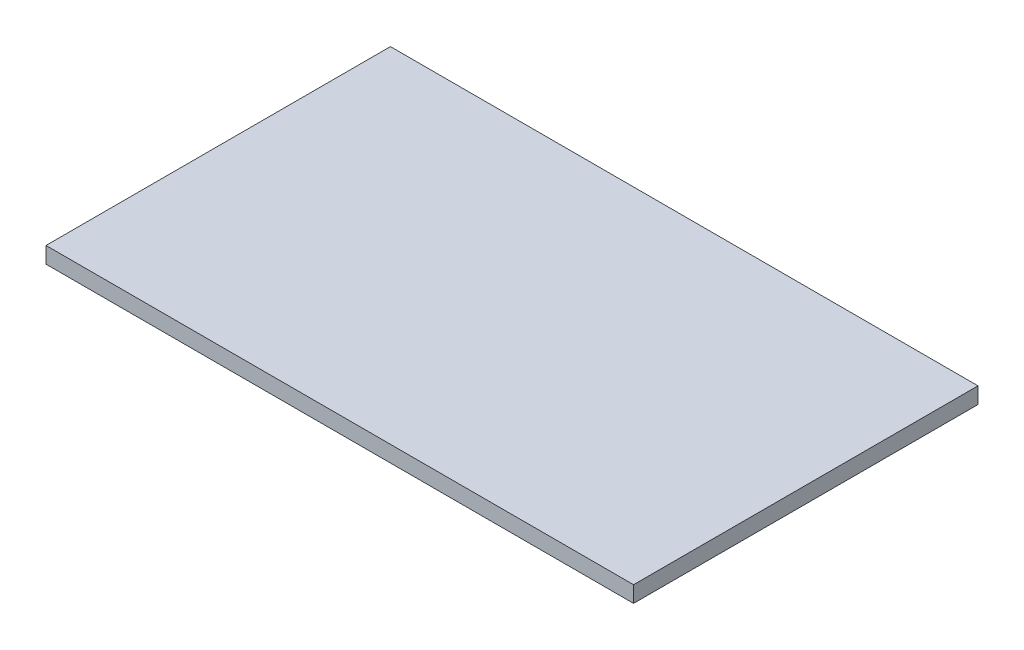
ISO-10303-21;
HEADER;
FILE_DESCRIPTION(('STEP AP214'),'2;1');
FILE_NAME('part.step','',(''),(''),'','','');
FILE_SCHEMA(('AUTOMOTIVE_DESIGN { 1 0 10303 214 1 1 1 1 }'));
ENDSEC;
DATA;
#1=APPLICATION_CONTEXT('core data for automotive mechanical design processes');
#2=APPLICATION_PROTOCOL_DEFINITION('international standard','automotive_design',2000,#1);
#3=PRODUCT_CONTEXT('',#1,'mechanical');
#4=PRODUCT('Part','Part','',(#3));
#5=PRODUCT_RELATED_PRODUCT_CATEGORY('part','',(#4));
#6=PRODUCT_DEFINITION_FORMATION('','',#4);
#7=PRODUCT_DEFINITION_CONTEXT('part definition',#1,'design');
#8=PRODUCT_DEFINITION('design','',#6,#7);
#9=PRODUCT_DEFINITION_SHAPE('','',#8);
#10=(LENGTH_UNIT() NAMED_UNIT(*) SI_UNIT(.MILLI.,.METRE.));
#11=(NAMED_UNIT(*) PLANE_ANGLE_UNIT() SI_UNIT($,.RADIAN.));
#12=(NAMED_UNIT(*) SI_UNIT($,.STERADIAN.) SOLID_ANGLE_UNIT());
#13=UNCERTAINTY_MEASURE_WITH_UNIT(LENGTH_MEASURE(1.E-05),#10,'distance_accuracy_value','');
#14=(GEOMETRIC_REPRESENTATION_CONTEXT(3) GLOBAL_UNCERTAINTY_ASSIGNED_CONTEXT((#13)) GLOBAL_UNIT_ASSIGNED_CONTEXT((#10,
#11,#12)) REPRESENTATION_CONTEXT('',''));
#15=CARTESIAN_POINT('',(0.,0.,0.));
#16=DIRECTION('',(0.,0.,1.));
#17=DIRECTION('',(1.,0.,0.));
#18=AXIS2_PLACEMENT_3D('',#15,#16,#17);
#19=CARTESIAN_POINT('',(72.5,4.,42.5));
#20=DIRECTION('',(-1.,0.,0.));
#21=DIRECTION('',(0.,0.,1.));
#22=AXIS2_PLACEMENT_3D('',#19,#20,#21);
#23=PLANE('',#22);
#24=DIRECTION('',(0.,0.,-1.));
#25=VECTOR('',#24,1.);
#26=CARTESIAN_POINT('',(72.5,0.,42.5));
#27=LINE('',#26,#25);
#28=CARTESIAN_POINT('',(72.5,0.,42.5));
#29=VERTEX_POINT('',#28);
#30=CARTESIAN_POINT('',(72.5,0.,-42.5));
#31=VERTEX_POINT('',#30);
#32=EDGE_CURVE('E100',#29,#31,#27,.T.);
#33=ORIENTED_EDGE('',*,*,#32,.T.);
#34=DIRECTION('',(0.,-1.,0.));
#35=VECTOR('',#34,1.);
#36=CARTESIAN_POINT('',(72.5,4.,-42.5));
#37=LINE('',#36,#35);
#38=CARTESIAN_POINT('',(72.5,4.,-42.5));
#39=VERTEX_POINT('',#38);
#40=EDGE_CURVE('E11',#39,#31,#37,.T.);
#41=ORIENTED_EDGE('',*,*,#40,.F.);
#42=DIRECTION('',(0.,0.,-1.));
#43=VECTOR('',#42,1.);
#44=CARTESIAN_POINT('',(72.5,4.,42.5));
#45=LINE('',#44,#43);
#46=CARTESIAN_POINT('',(72.5,4.,42.5));
#47=VERTEX_POINT('',#46);
#48=EDGE_CURVE('E88',#47,#39,#45,.T.);
#49=ORIENTED_EDGE('',*,*,#48,.F.);
#50=DIRECTION('',(0.,-1.,0.));
#51=VECTOR('',#50,1.);
#52=CARTESIAN_POINT('',(72.5,4.,42.5));
#53=LINE('',#52,#51);
#54=EDGE_CURVE('E96',#47,#29,#53,.T.);
#55=ORIENTED_EDGE('',*,*,#54,.T.);
#56=EDGE_LOOP('',(#33,#41,#49,#55));
#57=FACE_BOUND('',#56,.T.);
#58=ADVANCED_FACE('F37',(#57),#23,.F.);
#59=CARTESIAN_POINT('',(-72.5,4.,-42.5));
#60=DIRECTION('',(0.,0.,1.));
#61=DIRECTION('',(1.,0.,0.));
#62=AXIS2_PLACEMENT_3D('',#59,#60,#61);
#63=PLANE('',#62);
#64=DIRECTION('',(-1.,0.,0.));
#65=VECTOR('',#64,1.);
#66=CARTESIAN_POINT('',(-72.5,0.,-42.5));
#67=LINE('',#66,#65);
#68=CARTESIAN_POINT('',(-72.5,0.,-42.5));
#69=VERTEX_POINT('',#68);
#70=EDGE_CURVE('E92',#31,#69,#67,.T.);
#71=ORIENTED_EDGE('',*,*,#70,.T.);
#72=DIRECTION('',(0.,-1.,0.));
#73=VECTOR('',#72,1.);
#74=CARTESIAN_POINT('',(-72.5,4.,-42.5));
#75=LINE('',#74,#73);
#76=CARTESIAN_POINT('',(-72.5,4.,-42.5));
#77=VERTEX_POINT('',#76);
#78=EDGE_CURVE('E45',#77,#69,#75,.T.);
#79=ORIENTED_EDGE('',*,*,#78,.F.);
#80=DIRECTION('',(-1.,0.,0.));
#81=VECTOR('',#80,1.);
#82=CARTESIAN_POINT('',(-72.5,4.,-42.5));
#83=LINE('',#82,#81);
#84=EDGE_CURVE('E83',#39,#77,#83,.T.);
#85=ORIENTED_EDGE('',*,*,#84,.F.);
#86=ORIENTED_EDGE('',*,*,#40,.T.);
#87=EDGE_LOOP('',(#71,#79,#85,#86));
#88=FACE_BOUND('',#87,.T.);
#89=ADVANCED_FACE('F91',(#88),#63,.F.);
#90=CARTESIAN_POINT('',(-72.5,4.,42.5));
#91=DIRECTION('',(1.,0.,0.));
#92=DIRECTION('',(0.,0.,-1.));
#93=AXIS2_PLACEMENT_3D('',#90,#91,#92);
#94=PLANE('',#93);
#95=DIRECTION('',(0.,0.,1.));
#96=VECTOR('',#95,1.);
#97=CARTESIAN_POINT('',(-72.5,0.,42.5));
#98=LINE('',#97,#96);
#99=CARTESIAN_POINT('',(-72.5,0.,42.5));
#100=VERTEX_POINT('',#99);
#101=EDGE_CURVE('E70',#69,#100,#98,.T.);
#102=ORIENTED_EDGE('',*,*,#101,.T.);
#103=DIRECTION('',(0.,-1.,0.));
#104=VECTOR('',#103,1.);
#105=CARTESIAN_POINT('',(-72.5,4.,42.5));
#106=LINE('',#105,#104);
#107=CARTESIAN_POINT('',(-72.5,4.,42.5));
#108=VERTEX_POINT('',#107);
#109=EDGE_CURVE('E93',#108,#100,#106,.T.);
#110=ORIENTED_EDGE('',*,*,#109,.F.);
#111=DIRECTION('',(0.,0.,1.));
#112=VECTOR('',#111,1.);
#113=CARTESIAN_POINT('',(-72.5,4.,42.5));
#114=LINE('',#113,#112);
#115=EDGE_CURVE('E86',#77,#108,#114,.T.);
#116=ORIENTED_EDGE('',*,*,#115,.F.);
#117=ORIENTED_EDGE('',*,*,#78,.T.);
#118=EDGE_LOOP('',(#102,#110,#116,#117));
#119=FACE_BOUND('',#118,.T.);
#120=ADVANCED_FACE('F94',(#119),#94,.F.);
#121=CARTESIAN_POINT('',(-72.5,4.,42.5));
#122=DIRECTION('',(0.,0.,-1.));
#123=DIRECTION('',(-1.,0.,0.));
#124=AXIS2_PLACEMENT_3D('',#121,#122,#123);
#125=PLANE('',#124);
#126=DIRECTION('',(1.,0.,0.));
#127=VECTOR('',#126,1.);
#128=CARTESIAN_POINT('',(-72.5,0.,42.5));
#129=LINE('',#128,#127);
#130=EDGE_CURVE('E76',#100,#29,#129,.T.);
#131=ORIENTED_EDGE('',*,*,#130,.T.);
#132=ORIENTED_EDGE('',*,*,#54,.F.);
#133=DIRECTION('',(1.,0.,0.));
#134=VECTOR('',#133,1.);
#135=CARTESIAN_POINT('',(-72.5,4.,42.5));
#136=LINE('',#135,#134);
#137=EDGE_CURVE('E53',#108,#47,#136,.T.);
#138=ORIENTED_EDGE('',*,*,#137,.F.);
#139=ORIENTED_EDGE('',*,*,#109,.T.);
#140=EDGE_LOOP('',(#131,#132,#138,#139));
#141=FACE_BOUND('',#140,.T.);
#142=ADVANCED_FACE('F107',(#141),#125,.F.);
#143=CARTESIAN_POINT('',(0.,4.,0.));
#144=DIRECTION('',(0.,-1.,0.));
#145=DIRECTION('',(0.,0.,-1.));
#146=AXIS2_PLACEMENT_3D('',#143,#144,#145);
#147=PLANE('',#146);
#148=ORIENTED_EDGE('',*,*,#48,.T.);
#149=ORIENTED_EDGE('',*,*,#84,.T.);
#150=ORIENTED_EDGE('',*,*,#115,.T.);
#151=ORIENTED_EDGE('',*,*,#137,.T.);
#152=EDGE_LOOP('',(#148,#149,#150,#151));
#153=FACE_BOUND('',#152,.T.);
#154=ADVANCED_FACE('F84',(#153),#147,.F.);
#155=CARTESIAN_POINT('',(0.,0.,0.));
#156=DIRECTION('',(0.,-1.,0.));
#157=DIRECTION('',(0.,0.,-1.));
#158=AXIS2_PLACEMENT_3D('',#155,#156,#157);
#159=PLANE('',#158);
#160=ORIENTED_EDGE('',*,*,#32,.F.);
#161=ORIENTED_EDGE('',*,*,#130,.F.);
#162=ORIENTED_EDGE('',*,*,#101,.F.);
#163=ORIENTED_EDGE('',*,*,#70,.F.);
#164=EDGE_LOOP('',(#160,#161,#162,#163));
#165=FACE_BOUND('',#164,.T.);
#166=ADVANCED_FACE('F110',(#165),#159,.T.);
#167=CLOSED_SHELL('',(#58,#89,#120,#142,#154,#166));
#168=MANIFOLD_SOLID_BREP('B2',#167);
#169=ADVANCED_BREP_SHAPE_REPRESENTATION('',(#18,#168),#14);
#170=SHAPE_DEFINITION_REPRESENTATION(#9,#169);
ENDSEC;
END-ISO-10303-21;
